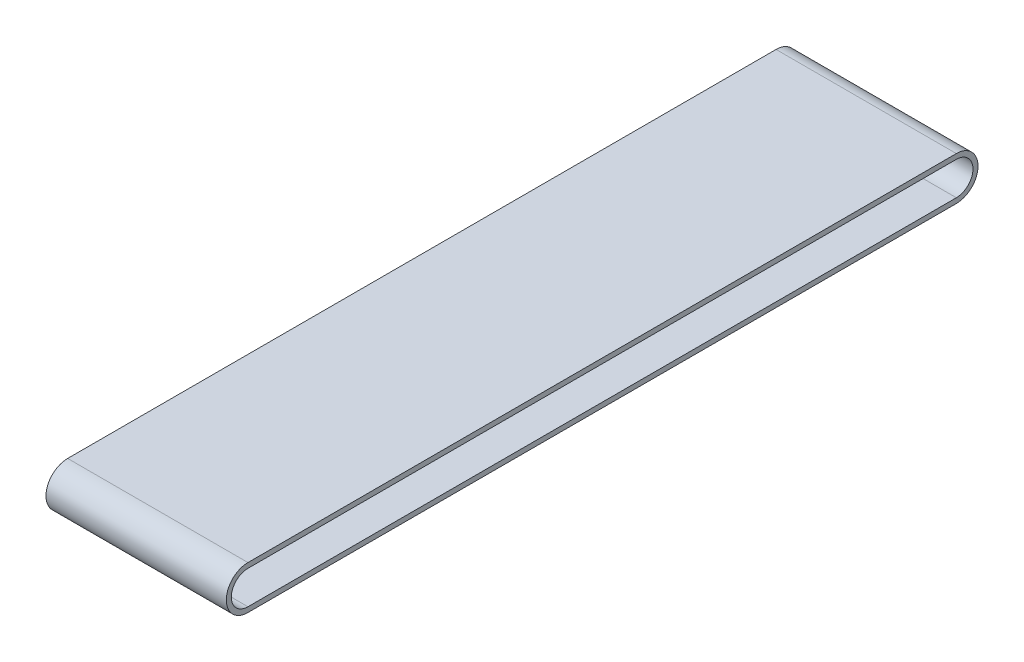
ISO-10303-21;
HEADER;
FILE_DESCRIPTION(('STEP AP214'),'2;1');
FILE_NAME('part.step','',(''),(''),'','','');
FILE_SCHEMA(('AUTOMOTIVE_DESIGN { 1 0 10303 214 1 1 1 1 }'));
ENDSEC;
DATA;
#1=APPLICATION_CONTEXT('core data for automotive mechanical design processes');
#2=APPLICATION_PROTOCOL_DEFINITION('international standard','automotive_design',2000,#1);
#3=PRODUCT_CONTEXT('',#1,'mechanical');
#4=PRODUCT('Part','Part','',(#3));
#5=PRODUCT_RELATED_PRODUCT_CATEGORY('part','',(#4));
#6=PRODUCT_DEFINITION_FORMATION('','',#4);
#7=PRODUCT_DEFINITION_CONTEXT('part definition',#1,'design');
#8=PRODUCT_DEFINITION('design','',#6,#7);
#9=PRODUCT_DEFINITION_SHAPE('','',#8);
#10=(LENGTH_UNIT() NAMED_UNIT(*) SI_UNIT(.MILLI.,.METRE.));
#11=(NAMED_UNIT(*) PLANE_ANGLE_UNIT() SI_UNIT($,.RADIAN.));
#12=(NAMED_UNIT(*) SI_UNIT($,.STERADIAN.) SOLID_ANGLE_UNIT());
#13=UNCERTAINTY_MEASURE_WITH_UNIT(LENGTH_MEASURE(1.E-05),#10,'distance_accuracy_value','');
#14=(GEOMETRIC_REPRESENTATION_CONTEXT(3) GLOBAL_UNCERTAINTY_ASSIGNED_CONTEXT((#13)) GLOBAL_UNIT_ASSIGNED_CONTEXT((#10,
#11,#12)) REPRESENTATION_CONTEXT('',''));
#15=CARTESIAN_POINT('',(0.,0.,0.));
#16=DIRECTION('',(0.,0.,1.));
#17=DIRECTION('',(1.,0.,0.));
#18=AXIS2_PLACEMENT_3D('',#15,#16,#17);
#19=CARTESIAN_POINT('',(250.,3.37153303092352,-513.239792120842));
#20=DIRECTION('',(1.,0.,0.));
#21=DIRECTION('',(0.,0.,-1.));
#22=AXIS2_PLACEMENT_3D('',#19,#20,#21);
#23=PLANE('',#22);
#24=CARTESIAN_POINT('',(250.,3.37153303092352,-513.239792120842));
#25=DIRECTION('',(1.,0.,0.));
#26=DIRECTION('',(0.,0.,-1.));
#27=AXIS2_PLACEMENT_3D('',#24,#25,#26);
#28=CIRCLE('',#27,30.0296044671198);
#29=CARTESIAN_POINT('',(250.,-26.6580714361963,-513.239792120842));
#30=VERTEX_POINT('',#29);
#31=CARTESIAN_POINT('',(250.,33.4011374980433,-513.239792120842));
#32=VERTEX_POINT('',#31);
#33=EDGE_CURVE('E134',#30,#32,#28,.T.);
#34=ORIENTED_EDGE('',*,*,#33,.T.);
#35=DIRECTION('',(0.,0.,1.));
#36=VECTOR('',#35,1.);
#37=CARTESIAN_POINT('',(250.,33.4011374980433,-513.239792120842));
#38=LINE('',#37,#36);
#39=CARTESIAN_POINT('',(250.,33.4011374980707,469.03923700766));
#40=VERTEX_POINT('',#39);
#41=EDGE_CURVE('E137',#32,#40,#38,.T.);
#42=ORIENTED_EDGE('',*,*,#41,.T.);
#43=CARTESIAN_POINT('',(250.,3.37153303095084,469.03923700766));
#44=DIRECTION('',(1.,0.,0.));
#45=DIRECTION('',(0.,0.,-1.));
#46=AXIS2_PLACEMENT_3D('',#43,#44,#45);
#47=CIRCLE('',#46,30.0296044671198);
#48=CARTESIAN_POINT('',(250.,-26.6580714361964,469.03923700766));
#49=VERTEX_POINT('',#48);
#50=EDGE_CURVE('E140',#40,#49,#47,.T.);
#51=ORIENTED_EDGE('',*,*,#50,.T.);
#52=DIRECTION('',(0.,0.,-1.));
#53=VECTOR('',#52,1.);
#54=CARTESIAN_POINT('',(250.,-26.6580714361963,-513.239792120842));
#55=LINE('',#54,#53);
#56=EDGE_CURVE('E142',#49,#30,#55,.T.);
#57=ORIENTED_EDGE('',*,*,#56,.T.);
#58=EDGE_LOOP('',(#34,#42,#51,#57));
#59=FACE_BOUND('',#58,.T.);
#60=DIRECTION('',(0.,0.,-1.));
#61=VECTOR('',#60,1.);
#62=CARTESIAN_POINT('',(250.,-19.6781500486309,469.03923700766));
#63=LINE('',#62,#61);
#64=CARTESIAN_POINT('',(250.,-19.6781500486309,469.03923700766));
#65=VERTEX_POINT('',#64);
#66=CARTESIAN_POINT('',(250.,-19.6781500486582,-513.239792120842));
#67=VERTEX_POINT('',#66);
#68=EDGE_CURVE('E106',#65,#67,#63,.T.);
#69=ORIENTED_EDGE('',*,*,#68,.F.);
#70=CARTESIAN_POINT('',(250.,3.37153303095084,469.03923700766));
#71=DIRECTION('',(1.,0.,0.));
#72=DIRECTION('',(0.,0.,-1.));
#73=AXIS2_PLACEMENT_3D('',#70,#71,#72);
#74=CIRCLE('',#73,23.0496830795817);
#75=CARTESIAN_POINT('',(250.,26.4212161105326,469.03923700766));
#76=VERTEX_POINT('',#75);
#77=EDGE_CURVE('E98',#76,#65,#74,.T.);
#78=ORIENTED_EDGE('',*,*,#77,.F.);
#79=DIRECTION('',(0.,0.,1.));
#80=VECTOR('',#79,1.);
#81=CARTESIAN_POINT('',(250.,26.4212161105326,469.03923700766));
#82=LINE('',#81,#80);
#83=CARTESIAN_POINT('',(250.,26.4212161105326,-513.239792120842));
#84=VERTEX_POINT('',#83);
#85=EDGE_CURVE('E120',#84,#76,#82,.T.);
#86=ORIENTED_EDGE('',*,*,#85,.F.);
#87=CARTESIAN_POINT('',(250.,3.37153303092352,-513.239792120842));
#88=DIRECTION('',(1.,0.,0.));
#89=DIRECTION('',(0.,0.,-1.));
#90=AXIS2_PLACEMENT_3D('',#87,#88,#89);
#91=CIRCLE('',#90,23.0496830795817);
#92=EDGE_CURVE('E118',#67,#84,#91,.T.);
#93=ORIENTED_EDGE('',*,*,#92,.F.);
#94=EDGE_LOOP('',(#69,#78,#86,#93));
#95=FACE_BOUND('',#94,.T.);
#96=ADVANCED_FACE('F33',(#59,#95),#23,.T.);
#97=CARTESIAN_POINT('',(0.,3.37153303092352,-513.239792120842));
#98=DIRECTION('',(1.,0.,0.));
#99=DIRECTION('',(0.,0.,-1.));
#100=AXIS2_PLACEMENT_3D('',#97,#98,#99);
#101=PLANE('',#100);
#102=CARTESIAN_POINT('',(0.,3.37153303092352,-513.239792120842));
#103=DIRECTION('',(1.,0.,0.));
#104=DIRECTION('',(0.,0.,-1.));
#105=AXIS2_PLACEMENT_3D('',#102,#103,#104);
#106=CIRCLE('',#105,30.0296044671198);
#107=CARTESIAN_POINT('',(0.,-26.6580714361963,-513.239792120842));
#108=VERTEX_POINT('',#107);
#109=CARTESIAN_POINT('',(0.,33.4011374980433,-513.239792120842));
#110=VERTEX_POINT('',#109);
#111=EDGE_CURVE('E114',#108,#110,#106,.T.);
#112=ORIENTED_EDGE('',*,*,#111,.F.);
#113=DIRECTION('',(0.,0.,-1.));
#114=VECTOR('',#113,1.);
#115=CARTESIAN_POINT('',(0.,-26.6580714361963,-513.239792120842));
#116=LINE('',#115,#114);
#117=CARTESIAN_POINT('',(0.,-26.6580714361964,469.03923700766));
#118=VERTEX_POINT('',#117);
#119=EDGE_CURVE('E138',#118,#108,#116,.T.);
#120=ORIENTED_EDGE('',*,*,#119,.F.);
#121=CARTESIAN_POINT('',(0.,3.37153303095084,469.03923700766));
#122=DIRECTION('',(1.,0.,0.));
#123=DIRECTION('',(0.,0.,-1.));
#124=AXIS2_PLACEMENT_3D('',#121,#122,#123);
#125=CIRCLE('',#124,30.0296044671198);
#126=CARTESIAN_POINT('',(0.,33.4011374980707,469.03923700766));
#127=VERTEX_POINT('',#126);
#128=EDGE_CURVE('E149',#127,#118,#125,.T.);
#129=ORIENTED_EDGE('',*,*,#128,.F.);
#130=DIRECTION('',(0.,0.,1.));
#131=VECTOR('',#130,1.);
#132=CARTESIAN_POINT('',(0.,33.4011374980433,-513.239792120842));
#133=LINE('',#132,#131);
#134=EDGE_CURVE('E147',#110,#127,#133,.T.);
#135=ORIENTED_EDGE('',*,*,#134,.F.);
#136=EDGE_LOOP('',(#112,#120,#129,#135));
#137=FACE_BOUND('',#136,.T.);
#138=CARTESIAN_POINT('',(0.,3.37153303095084,469.03923700766));
#139=DIRECTION('',(1.,0.,0.));
#140=DIRECTION('',(0.,0.,-1.));
#141=AXIS2_PLACEMENT_3D('',#138,#139,#140);
#142=CIRCLE('',#141,23.0496830795817);
#143=CARTESIAN_POINT('',(0.,26.4212161105326,469.03923700766));
#144=VERTEX_POINT('',#143);
#145=CARTESIAN_POINT('',(0.,-19.6781500486309,469.03923700766));
#146=VERTEX_POINT('',#145);
#147=EDGE_CURVE('E56',#144,#146,#142,.T.);
#148=ORIENTED_EDGE('',*,*,#147,.T.);
#149=DIRECTION('',(0.,0.,-1.));
#150=VECTOR('',#149,1.);
#151=CARTESIAN_POINT('',(0.,-19.6781500486309,469.03923700766));
#152=LINE('',#151,#150);
#153=CARTESIAN_POINT('',(0.,-19.6781500486582,-513.239792120842));
#154=VERTEX_POINT('',#153);
#155=EDGE_CURVE('E113',#146,#154,#152,.T.);
#156=ORIENTED_EDGE('',*,*,#155,.T.);
#157=CARTESIAN_POINT('',(0.,3.37153303092352,-513.239792120842));
#158=DIRECTION('',(1.,0.,0.));
#159=DIRECTION('',(0.,0.,-1.));
#160=AXIS2_PLACEMENT_3D('',#157,#158,#159);
#161=CIRCLE('',#160,23.0496830795817);
#162=CARTESIAN_POINT('',(0.,26.4212161105326,-513.239792120842));
#163=VERTEX_POINT('',#162);
#164=EDGE_CURVE('E126',#154,#163,#161,.T.);
#165=ORIENTED_EDGE('',*,*,#164,.T.);
#166=DIRECTION('',(0.,0.,1.));
#167=VECTOR('',#166,1.);
#168=CARTESIAN_POINT('',(0.,26.4212161105326,469.03923700766));
#169=LINE('',#168,#167);
#170=EDGE_CURVE('E107',#163,#144,#169,.T.);
#171=ORIENTED_EDGE('',*,*,#170,.T.);
#172=EDGE_LOOP('',(#148,#156,#165,#171));
#173=FACE_BOUND('',#172,.T.);
#174=ADVANCED_FACE('F167',(#137,#173),#101,.F.);
#175=CARTESIAN_POINT('',(250.,3.37153303092352,-513.239792120842));
#176=DIRECTION('',(-1.,0.,0.));
#177=DIRECTION('',(0.,0.,1.));
#178=AXIS2_PLACEMENT_3D('',#175,#176,#177);
#179=CYLINDRICAL_SURFACE('',#178,30.0296044671198);
#180=ORIENTED_EDGE('',*,*,#111,.T.);
#181=DIRECTION('',(-1.,0.,0.));
#182=VECTOR('',#181,1.);
#183=CARTESIAN_POINT('',(250.,33.4011374980433,-513.239792120842));
#184=LINE('',#183,#182);
#185=EDGE_CURVE('E11',#32,#110,#184,.T.);
#186=ORIENTED_EDGE('',*,*,#185,.F.);
#187=ORIENTED_EDGE('',*,*,#33,.F.);
#188=DIRECTION('',(-1.,0.,0.));
#189=VECTOR('',#188,1.);
#190=CARTESIAN_POINT('',(250.,-26.6580714361963,-513.239792120842));
#191=LINE('',#190,#189);
#192=EDGE_CURVE('E144',#30,#108,#191,.T.);
#193=ORIENTED_EDGE('',*,*,#192,.T.);
#194=EDGE_LOOP('',(#180,#186,#187,#193));
#195=FACE_BOUND('',#194,.T.);
#196=ADVANCED_FACE('F35',(#195),#179,.T.);
#197=CARTESIAN_POINT('',(250.,33.4011374980433,-513.239792120842));
#198=DIRECTION('',(0.,-1.,0.));
#199=DIRECTION('',(0.,0.,-1.));
#200=AXIS2_PLACEMENT_3D('',#197,#198,#199);
#201=PLANE('',#200);
#202=ORIENTED_EDGE('',*,*,#134,.T.);
#203=DIRECTION('',(-1.,0.,0.));
#204=VECTOR('',#203,1.);
#205=CARTESIAN_POINT('',(250.,33.4011374980707,469.03923700766));
#206=LINE('',#205,#204);
#207=EDGE_CURVE('E41',#40,#127,#206,.T.);
#208=ORIENTED_EDGE('',*,*,#207,.F.);
#209=ORIENTED_EDGE('',*,*,#41,.F.);
#210=ORIENTED_EDGE('',*,*,#185,.T.);
#211=EDGE_LOOP('',(#202,#208,#209,#210));
#212=FACE_BOUND('',#211,.T.);
#213=ADVANCED_FACE('F177',(#212),#201,.F.);
#214=CARTESIAN_POINT('',(250.,3.37153303095084,469.03923700766));
#215=DIRECTION('',(-1.,0.,0.));
#216=DIRECTION('',(0.,0.,1.));
#217=AXIS2_PLACEMENT_3D('',#214,#215,#216);
#218=CYLINDRICAL_SURFACE('',#217,30.0296044671198);
#219=ORIENTED_EDGE('',*,*,#128,.T.);
#220=DIRECTION('',(-1.,0.,0.));
#221=VECTOR('',#220,1.);
#222=CARTESIAN_POINT('',(250.,-26.6580714361964,469.03923700766));
#223=LINE('',#222,#221);
#224=EDGE_CURVE('E154',#49,#118,#223,.T.);
#225=ORIENTED_EDGE('',*,*,#224,.F.);
#226=ORIENTED_EDGE('',*,*,#50,.F.);
#227=ORIENTED_EDGE('',*,*,#207,.T.);
#228=EDGE_LOOP('',(#219,#225,#226,#227));
#229=FACE_BOUND('',#228,.T.);
#230=ADVANCED_FACE('F161',(#229),#218,.T.);
#231=CARTESIAN_POINT('',(250.,-26.6580714361963,-513.239792120842));
#232=DIRECTION('',(0.,1.,0.));
#233=DIRECTION('',(0.,0.,1.));
#234=AXIS2_PLACEMENT_3D('',#231,#232,#233);
#235=PLANE('',#234);
#236=ORIENTED_EDGE('',*,*,#119,.T.);
#237=ORIENTED_EDGE('',*,*,#192,.F.);
#238=ORIENTED_EDGE('',*,*,#56,.F.);
#239=ORIENTED_EDGE('',*,*,#224,.T.);
#240=EDGE_LOOP('',(#236,#237,#238,#239));
#241=FACE_BOUND('',#240,.T.);
#242=ADVANCED_FACE('F171',(#241),#235,.F.);
#243=CARTESIAN_POINT('',(250.,3.37153303095084,469.03923700766));
#244=DIRECTION('',(-1.,0.,0.));
#245=DIRECTION('',(0.,0.,1.));
#246=AXIS2_PLACEMENT_3D('',#243,#244,#245);
#247=CYLINDRICAL_SURFACE('',#246,23.0496830795817);
#248=ORIENTED_EDGE('',*,*,#147,.F.);
#249=DIRECTION('',(-1.,0.,0.));
#250=VECTOR('',#249,1.);
#251=CARTESIAN_POINT('',(250.,26.4212161105326,469.03923700766));
#252=LINE('',#251,#250);
#253=EDGE_CURVE('E102',#76,#144,#252,.T.);
#254=ORIENTED_EDGE('',*,*,#253,.F.);
#255=ORIENTED_EDGE('',*,*,#77,.T.);
#256=DIRECTION('',(-1.,0.,0.));
#257=VECTOR('',#256,1.);
#258=CARTESIAN_POINT('',(250.,-19.6781500486309,469.03923700766));
#259=LINE('',#258,#257);
#260=EDGE_CURVE('E101',#65,#146,#259,.T.);
#261=ORIENTED_EDGE('',*,*,#260,.T.);
#262=EDGE_LOOP('',(#248,#254,#255,#261));
#263=FACE_BOUND('',#262,.T.);
#264=ADVANCED_FACE('F100',(#263),#247,.F.);
#265=CARTESIAN_POINT('',(250.,-19.6781500486309,469.03923700766));
#266=DIRECTION('',(0.,1.,0.));
#267=DIRECTION('',(0.,0.,1.));
#268=AXIS2_PLACEMENT_3D('',#265,#266,#267);
#269=PLANE('',#268);
#270=ORIENTED_EDGE('',*,*,#155,.F.);
#271=ORIENTED_EDGE('',*,*,#260,.F.);
#272=ORIENTED_EDGE('',*,*,#68,.T.);
#273=DIRECTION('',(-1.,0.,0.));
#274=VECTOR('',#273,1.);
#275=CARTESIAN_POINT('',(250.,-19.6781500486582,-513.239792120842));
#276=LINE('',#275,#274);
#277=EDGE_CURVE('E115',#67,#154,#276,.T.);
#278=ORIENTED_EDGE('',*,*,#277,.T.);
#279=EDGE_LOOP('',(#270,#271,#272,#278));
#280=FACE_BOUND('',#279,.T.);
#281=ADVANCED_FACE('F110',(#280),#269,.T.);
#282=CARTESIAN_POINT('',(250.,3.37153303092352,-513.239792120842));
#283=DIRECTION('',(-1.,0.,0.));
#284=DIRECTION('',(0.,0.,1.));
#285=AXIS2_PLACEMENT_3D('',#282,#283,#284);
#286=CYLINDRICAL_SURFACE('',#285,23.0496830795817);
#287=ORIENTED_EDGE('',*,*,#164,.F.);
#288=ORIENTED_EDGE('',*,*,#277,.F.);
#289=ORIENTED_EDGE('',*,*,#92,.T.);
#290=DIRECTION('',(-1.,0.,0.));
#291=VECTOR('',#290,1.);
#292=CARTESIAN_POINT('',(250.,26.4212161105326,-513.239792120842));
#293=LINE('',#292,#291);
#294=EDGE_CURVE('E48',#84,#163,#293,.T.);
#295=ORIENTED_EDGE('',*,*,#294,.T.);
#296=EDGE_LOOP('',(#287,#288,#289,#295));
#297=FACE_BOUND('',#296,.T.);
#298=ADVANCED_FACE('F200',(#297),#286,.F.);
#299=CARTESIAN_POINT('',(250.,26.4212161105326,469.03923700766));
#300=DIRECTION('',(0.,-1.,0.));
#301=DIRECTION('',(0.,0.,-1.));
#302=AXIS2_PLACEMENT_3D('',#299,#300,#301);
#303=PLANE('',#302);
#304=ORIENTED_EDGE('',*,*,#170,.F.);
#305=ORIENTED_EDGE('',*,*,#294,.F.);
#306=ORIENTED_EDGE('',*,*,#85,.T.);
#307=ORIENTED_EDGE('',*,*,#253,.T.);
#308=EDGE_LOOP('',(#304,#305,#306,#307));
#309=FACE_BOUND('',#308,.T.);
#310=ADVANCED_FACE('F204',(#309),#303,.T.);
#311=CLOSED_SHELL('',(#96,#174,#196,#213,#230,#242,#264,#281,#298,#310));
#312=MANIFOLD_SOLID_BREP('B2',#311);
#313=ADVANCED_BREP_SHAPE_REPRESENTATION('',(#18,#312),#14);
#314=SHAPE_DEFINITION_REPRESENTATION(#9,#313);
ENDSEC;
END-ISO-10303-21;
